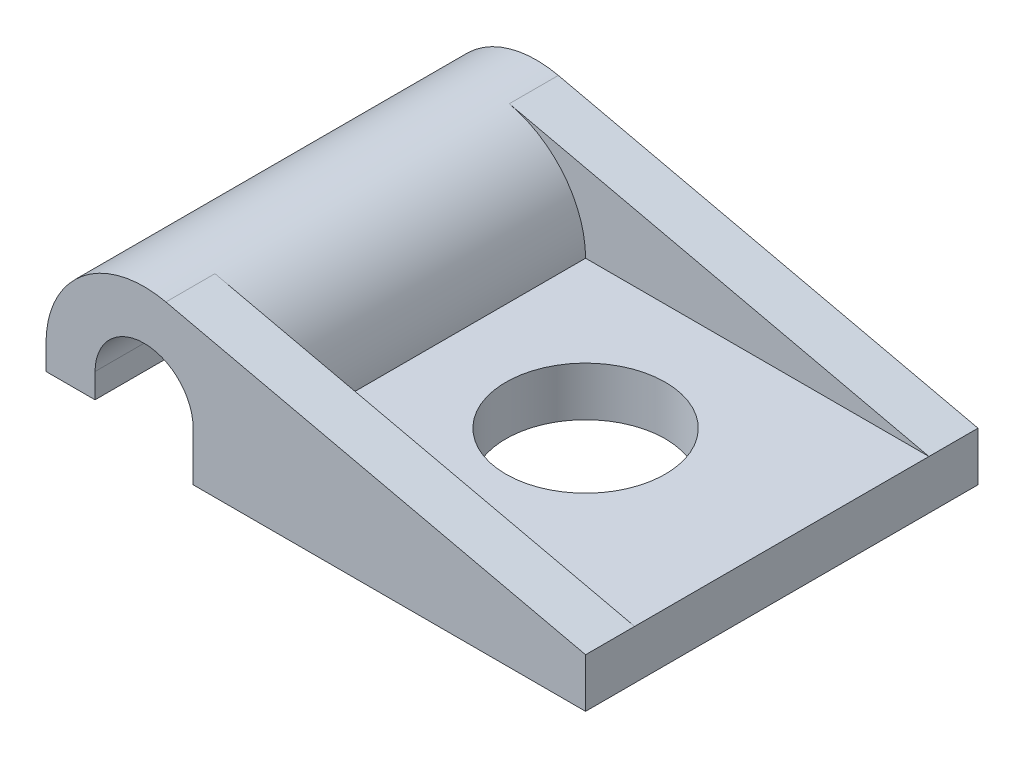
ISO-10303-21;
HEADER;
FILE_DESCRIPTION(('STEP AP214'),'2;1');
FILE_NAME('part.step','',(''),(''),'','','');
FILE_SCHEMA(('AUTOMOTIVE_DESIGN { 1 0 10303 214 1 1 1 1 }'));
ENDSEC;
DATA;
#1=APPLICATION_CONTEXT('core data for automotive mechanical design processes');
#2=APPLICATION_PROTOCOL_DEFINITION('international standard','automotive_design',2000,#1);
#3=PRODUCT_CONTEXT('',#1,'mechanical');
#4=PRODUCT('Part','Part','',(#3));
#5=PRODUCT_RELATED_PRODUCT_CATEGORY('part','',(#4));
#6=PRODUCT_DEFINITION_FORMATION('','',#4);
#7=PRODUCT_DEFINITION_CONTEXT('part definition',#1,'design');
#8=PRODUCT_DEFINITION('design','',#6,#7);
#9=PRODUCT_DEFINITION_SHAPE('','',#8);
#10=(LENGTH_UNIT() NAMED_UNIT(*) SI_UNIT(.MILLI.,.METRE.));
#11=(NAMED_UNIT(*) PLANE_ANGLE_UNIT() SI_UNIT($,.RADIAN.));
#12=(NAMED_UNIT(*) SI_UNIT($,.STERADIAN.) SOLID_ANGLE_UNIT());
#13=UNCERTAINTY_MEASURE_WITH_UNIT(LENGTH_MEASURE(1.E-05),#10,'distance_accuracy_value','');
#14=(GEOMETRIC_REPRESENTATION_CONTEXT(3) GLOBAL_UNCERTAINTY_ASSIGNED_CONTEXT((#13)) GLOBAL_UNIT_ASSIGNED_CONTEXT((#10,
#11,#12)) REPRESENTATION_CONTEXT('',''));
#15=CARTESIAN_POINT('',(0.,0.,0.));
#16=DIRECTION('',(0.,0.,1.));
#17=DIRECTION('',(1.,0.,0.));
#18=AXIS2_PLACEMENT_3D('',#15,#16,#17);
#19=CARTESIAN_POINT('',(1.5875,0.,6.35));
#20=DIRECTION('',(0.,1.,0.));
#21=DIRECTION('',(-1.,0.,0.));
#22=AXIS2_PLACEMENT_3D('',#19,#20,#21);
#23=PLANE('',#22);
#24=DIRECTION('',(1.,0.,0.));
#25=VECTOR('',#24,1.);
#26=CARTESIAN_POINT('',(1.5875,0.,-6.35));
#27=LINE('',#26,#25);
#28=CARTESIAN_POINT('',(1.5875,0.,-6.35));
#29=VERTEX_POINT('',#28);
#30=CARTESIAN_POINT('',(14.2875,0.,-6.35));
#31=VERTEX_POINT('',#30);
#32=EDGE_CURVE('E155',#29,#31,#27,.T.);
#33=ORIENTED_EDGE('',*,*,#32,.T.);
#34=DIRECTION('',(0.,0.,-1.));
#35=VECTOR('',#34,1.);
#36=CARTESIAN_POINT('',(14.2875,0.,6.35));
#37=LINE('',#36,#35);
#38=CARTESIAN_POINT('',(14.2875,0.,6.35));
#39=VERTEX_POINT('',#38);
#40=EDGE_CURVE('E181',#39,#31,#37,.T.);
#41=ORIENTED_EDGE('',*,*,#40,.F.);
#42=DIRECTION('',(1.,0.,0.));
#43=VECTOR('',#42,1.);
#44=CARTESIAN_POINT('',(1.5875,0.,6.35));
#45=LINE('',#44,#43);
#46=CARTESIAN_POINT('',(1.5875,0.,6.35));
#47=VERTEX_POINT('',#46);
#48=EDGE_CURVE('E225',#47,#39,#45,.T.);
#49=ORIENTED_EDGE('',*,*,#48,.F.);
#50=DIRECTION('',(0.,0.,-1.));
#51=VECTOR('',#50,1.);
#52=CARTESIAN_POINT('',(1.5875,0.,6.35));
#53=LINE('',#52,#51);
#54=EDGE_CURVE('E184',#47,#29,#53,.T.);
#55=ORIENTED_EDGE('',*,*,#54,.T.);
#56=EDGE_LOOP('',(#33,#41,#49,#55));
#57=FACE_BOUND('',#56,.T.);
#58=CARTESIAN_POINT('',(7.9375,0.,0.));
#59=DIRECTION('',(0.,1.,0.));
#60=DIRECTION('',(0.,0.,1.));
#61=AXIS2_PLACEMENT_3D('',#58,#59,#60);
#62=CIRCLE('',#61,2.5796875);
#63=CARTESIAN_POINT('',(7.9375,0.,2.5796875));
#64=VERTEX_POINT('',#63);
#65=EDGE_CURVE('E236',#64,#64,#62,.T.);
#66=ORIENTED_EDGE('',*,*,#65,.T.);
#67=EDGE_LOOP('',(#66));
#68=FACE_BOUND('',#67,.T.);
#69=ADVANCED_FACE('F34',(#57,#68),#23,.F.);
#70=CARTESIAN_POINT('',(3.17500000000012,1.5875,4.76249999999988));
#71=DIRECTION('',(0.,1.,0.));
#72=DIRECTION('',(0.,0.,1.));
#73=AXIS2_PLACEMENT_3D('',#70,#71,#72);
#74=PLANE('',#73);
#75=DIRECTION('',(0.,0.,1.));
#76=VECTOR('',#75,1.);
#77=CARTESIAN_POINT('',(3.17500000000012,1.5875,-4.76249999999988));
#78=LINE('',#77,#76);
#79=CARTESIAN_POINT('',(3.17500000000012,1.5875,-4.76249999999988));
#80=VERTEX_POINT('',#79);
#81=CARTESIAN_POINT('',(3.17500000000012,1.5875,4.76249999999988));
#82=VERTEX_POINT('',#81);
#83=EDGE_CURVE('E209',#80,#82,#78,.T.);
#84=ORIENTED_EDGE('',*,*,#83,.T.);
#85=DIRECTION('',(1.,0.,0.));
#86=VECTOR('',#85,1.);
#87=CARTESIAN_POINT('',(3.17500000000012,1.5875,4.76249999999988));
#88=LINE('',#87,#86);
#89=CARTESIAN_POINT('',(14.2875,1.5875,4.7625));
#90=VERTEX_POINT('',#89);
#91=EDGE_CURVE('E50',#82,#90,#88,.T.);
#92=ORIENTED_EDGE('',*,*,#91,.T.);
#93=DIRECTION('',(0.,0.,-1.));
#94=VECTOR('',#93,1.);
#95=CARTESIAN_POINT('',(14.2875,1.5875,-4.7625));
#96=LINE('',#95,#94);
#97=CARTESIAN_POINT('',(14.2875,1.5875,-4.7625));
#98=VERTEX_POINT('',#97);
#99=EDGE_CURVE('E230',#90,#98,#96,.T.);
#100=ORIENTED_EDGE('',*,*,#99,.T.);
#101=DIRECTION('',(-1.,0.,0.));
#102=VECTOR('',#101,1.);
#103=CARTESIAN_POINT('',(3.17500000000012,1.5875,-4.76249999999988));
#104=LINE('',#103,#102);
#105=EDGE_CURVE('E153',#98,#80,#104,.T.);
#106=ORIENTED_EDGE('',*,*,#105,.T.);
#107=EDGE_LOOP('',(#84,#92,#100,#106));
#108=FACE_BOUND('',#107,.T.);
#109=CARTESIAN_POINT('',(7.9375,1.5875,0.));
#110=DIRECTION('',(0.,1.,0.));
#111=DIRECTION('',(0.,0.,1.));
#112=AXIS2_PLACEMENT_3D('',#109,#110,#111);
#113=CIRCLE('',#112,2.5796875);
#114=CARTESIAN_POINT('',(7.9375,1.5875,2.5796875));
#115=VERTEX_POINT('',#114);
#116=EDGE_CURVE('E38',#115,#115,#113,.F.);
#117=ORIENTED_EDGE('',*,*,#116,.T.);
#118=EDGE_LOOP('',(#117));
#119=FACE_BOUND('',#118,.T.);
#120=ADVANCED_FACE('F243',(#108,#119),#74,.T.);
#121=CARTESIAN_POINT('',(14.2875,1.5875,6.35));
#122=DIRECTION('',(-0.222222222222222,-0.974996043043569,0.));
#123=DIRECTION('',(0.974996043043569,-0.222222222222222,0.));
#124=AXIS2_PLACEMENT_3D('',#121,#122,#123);
#125=PLANE('',#124);
#126=DIRECTION('',(0.974996043043569,-0.222222222222222,0.));
#127=VECTOR('',#126,1.);
#128=CARTESIAN_POINT('',(14.2875,1.5875,4.7625));
#129=LINE('',#128,#127);
#130=CARTESIAN_POINT('',(0.705555555555576,4.68311243666342,4.76249999999985));
#131=VERTEX_POINT('',#130);
#132=EDGE_CURVE('E11',#131,#90,#129,.T.);
#133=ORIENTED_EDGE('',*,*,#132,.F.);
#134=DIRECTION('',(0.,0.,-1.));
#135=VECTOR('',#134,1.);
#136=CARTESIAN_POINT('',(0.705555555555569,4.68311243666339,6.35));
#137=LINE('',#136,#135);
#138=CARTESIAN_POINT('',(0.705555555555569,4.68311243666339,6.35));
#139=VERTEX_POINT('',#138);
#140=EDGE_CURVE('E174',#139,#131,#137,.T.);
#141=ORIENTED_EDGE('',*,*,#140,.F.);
#142=DIRECTION('',(-0.974996043043569,0.222222222222222,0.));
#143=VECTOR('',#142,1.);
#144=CARTESIAN_POINT('',(14.2875,1.5875,6.35));
#145=LINE('',#144,#143);
#146=CARTESIAN_POINT('',(14.2875,1.5875,6.35));
#147=VERTEX_POINT('',#146);
#148=EDGE_CURVE('E220',#147,#139,#145,.T.);
#149=ORIENTED_EDGE('',*,*,#148,.F.);
#150=DIRECTION('',(0.,0.,-1.));
#151=VECTOR('',#150,1.);
#152=CARTESIAN_POINT('',(14.2875,1.5875,6.35));
#153=LINE('',#152,#151);
#154=EDGE_CURVE('E178',#147,#90,#153,.T.);
#155=ORIENTED_EDGE('',*,*,#154,.T.);
#156=EDGE_LOOP('',(#133,#141,#149,#155));
#157=FACE_BOUND('',#156,.T.);
#158=ADVANCED_FACE('F261',(#157),#125,.F.);
#159=CARTESIAN_POINT('',(0.705555555555576,4.68311243666342,-4.76249999999985));
#160=VERTEX_POINT('',#159);
#161=CARTESIAN_POINT('',(0.705555555555569,4.68311243666339,-6.35));
#162=VERTEX_POINT('',#161);
#163=EDGE_CURVE('E173',#160,#162,#137,.T.);
#164=ORIENTED_EDGE('',*,*,#163,.F.);
#165=DIRECTION('',(-0.974996043043569,0.222222222222222,0.));
#166=VECTOR('',#165,1.);
#167=CARTESIAN_POINT('',(14.2874999999999,1.58750000000003,-4.7625));
#168=LINE('',#167,#166);
#169=EDGE_CURVE('E43',#98,#160,#168,.T.);
#170=ORIENTED_EDGE('',*,*,#169,.F.);
#171=CARTESIAN_POINT('',(14.2875,1.5875,-6.35));
#172=VERTEX_POINT('',#171);
#173=EDGE_CURVE('E177',#98,#172,#153,.T.);
#174=ORIENTED_EDGE('',*,*,#173,.T.);
#175=DIRECTION('',(-0.974996043043569,0.222222222222222,0.));
#176=VECTOR('',#175,1.);
#177=CARTESIAN_POINT('',(14.2875,1.5875,-6.35));
#178=LINE('',#177,#176);
#179=EDGE_CURVE('E160',#172,#162,#178,.T.);
#180=ORIENTED_EDGE('',*,*,#179,.T.);
#181=EDGE_LOOP('',(#164,#170,#174,#180));
#182=FACE_BOUND('',#181,.T.);
#183=ADVANCED_FACE('F212',(#182),#125,.F.);
#184=CARTESIAN_POINT('',(0.,1.5875,6.35));
#185=DIRECTION('',(0.,0.,-1.));
#186=DIRECTION('',(-1.,0.,0.));
#187=AXIS2_PLACEMENT_3D('',#184,#185,#186);
#188=CYLINDRICAL_SURFACE('',#187,1.5875);
#189=CARTESIAN_POINT('',(0.,1.5875,-6.35));
#190=DIRECTION('',(0.,0.,-1.));
#191=DIRECTION('',(1.,0.,0.));
#192=AXIS2_PLACEMENT_3D('',#189,#190,#191);
#193=CIRCLE('',#192,1.5875);
#194=CARTESIAN_POINT('',(-1.5875,1.5875,-6.35));
#195=VERTEX_POINT('',#194);
#196=CARTESIAN_POINT('',(1.5875,1.5875,-6.35));
#197=VERTEX_POINT('',#196);
#198=EDGE_CURVE('E149',#195,#197,#193,.T.);
#199=ORIENTED_EDGE('',*,*,#198,.T.);
#200=DIRECTION('',(0.,0.,-1.));
#201=VECTOR('',#200,1.);
#202=CARTESIAN_POINT('',(1.5875,1.5875,6.35));
#203=LINE('',#202,#201);
#204=CARTESIAN_POINT('',(1.5875,1.5875,6.35));
#205=VERTEX_POINT('',#204);
#206=EDGE_CURVE('E187',#205,#197,#203,.T.);
#207=ORIENTED_EDGE('',*,*,#206,.F.);
#208=CARTESIAN_POINT('',(0.,1.5875,6.35));
#209=DIRECTION('',(0.,0.,-1.));
#210=DIRECTION('',(1.,0.,0.));
#211=AXIS2_PLACEMENT_3D('',#208,#209,#210);
#212=CIRCLE('',#211,1.5875);
#213=CARTESIAN_POINT('',(-1.5875,1.5875,6.35));
#214=VERTEX_POINT('',#213);
#215=EDGE_CURVE('E169',#214,#205,#212,.T.);
#216=ORIENTED_EDGE('',*,*,#215,.F.);
#217=DIRECTION('',(0.,0.,-1.));
#218=VECTOR('',#217,1.);
#219=CARTESIAN_POINT('',(-1.5875,1.5875,6.35));
#220=LINE('',#219,#218);
#221=EDGE_CURVE('E145',#214,#195,#220,.T.);
#222=ORIENTED_EDGE('',*,*,#221,.T.);
#223=EDGE_LOOP('',(#199,#207,#216,#222));
#224=FACE_BOUND('',#223,.T.);
#225=ADVANCED_FACE('F36',(#224),#188,.F.);
#226=CARTESIAN_POINT('',(1.5875,1.5875,6.35));
#227=DIRECTION('',(1.,0.,0.));
#228=DIRECTION('',(0.,0.,-1.));
#229=AXIS2_PLACEMENT_3D('',#226,#227,#228);
#230=PLANE('',#229);
#231=DIRECTION('',(0.,-1.,0.));
#232=VECTOR('',#231,1.);
#233=CARTESIAN_POINT('',(1.5875,1.5875,-6.35));
#234=LINE('',#233,#232);
#235=EDGE_CURVE('E152',#197,#29,#234,.T.);
#236=ORIENTED_EDGE('',*,*,#235,.T.);
#237=ORIENTED_EDGE('',*,*,#54,.F.);
#238=DIRECTION('',(0.,-1.,0.));
#239=VECTOR('',#238,1.);
#240=CARTESIAN_POINT('',(1.5875,1.5875,6.35));
#241=LINE('',#240,#239);
#242=EDGE_CURVE('E103',#205,#47,#241,.T.);
#243=ORIENTED_EDGE('',*,*,#242,.F.);
#244=ORIENTED_EDGE('',*,*,#206,.T.);
#245=EDGE_LOOP('',(#236,#237,#243,#244));
#246=FACE_BOUND('',#245,.T.);
#247=ADVANCED_FACE('F265',(#246),#230,.F.);
#248=CARTESIAN_POINT('',(14.2875,0.,6.35));
#249=DIRECTION('',(-1.,0.,0.));
#250=DIRECTION('',(0.,0.,1.));
#251=AXIS2_PLACEMENT_3D('',#248,#249,#250);
#252=PLANE('',#251);
#253=DIRECTION('',(0.,1.,0.));
#254=VECTOR('',#253,1.);
#255=CARTESIAN_POINT('',(14.2875,0.,-6.35));
#256=LINE('',#255,#254);
#257=EDGE_CURVE('E157',#31,#172,#256,.T.);
#258=ORIENTED_EDGE('',*,*,#257,.T.);
#259=ORIENTED_EDGE('',*,*,#173,.F.);
#260=ORIENTED_EDGE('',*,*,#99,.F.);
#261=ORIENTED_EDGE('',*,*,#154,.F.);
#262=DIRECTION('',(0.,1.,0.));
#263=VECTOR('',#262,1.);
#264=CARTESIAN_POINT('',(14.2875,0.,6.35));
#265=LINE('',#264,#263);
#266=EDGE_CURVE('E221',#39,#147,#265,.T.);
#267=ORIENTED_EDGE('',*,*,#266,.F.);
#268=ORIENTED_EDGE('',*,*,#40,.T.);
#269=EDGE_LOOP('',(#258,#259,#260,#261,#267,#268));
#270=FACE_BOUND('',#269,.T.);
#271=ADVANCED_FACE('F263',(#270),#252,.F.);
#272=CARTESIAN_POINT('',(0.,1.5875,6.35));
#273=DIRECTION('',(0.,0.,-1.));
#274=DIRECTION('',(-1.,0.,0.));
#275=AXIS2_PLACEMENT_3D('',#272,#273,#274);
#276=CYLINDRICAL_SURFACE('',#275,3.17500000000006);
#277=CARTESIAN_POINT('',(0.,1.5875,-6.35));
#278=DIRECTION('',(0.,0.,1.));
#279=DIRECTION('',(-1.,0.,0.));
#280=AXIS2_PLACEMENT_3D('',#277,#278,#279);
#281=CIRCLE('',#280,3.17500000000006);
#282=CARTESIAN_POINT('',(-3.17500000000012,1.5875,-6.35));
#283=VERTEX_POINT('',#282);
#284=EDGE_CURVE('E163',#162,#283,#281,.T.);
#285=ORIENTED_EDGE('',*,*,#284,.T.);
#286=DIRECTION('',(0.,0.,-1.));
#287=VECTOR('',#286,1.);
#288=CARTESIAN_POINT('',(-3.17500000000012,1.5875,6.35));
#289=LINE('',#288,#287);
#290=CARTESIAN_POINT('',(-3.17500000000012,1.5875,6.35));
#291=VERTEX_POINT('',#290);
#292=EDGE_CURVE('E140',#291,#283,#289,.T.);
#293=ORIENTED_EDGE('',*,*,#292,.F.);
#294=CARTESIAN_POINT('',(0.,1.5875,6.35));
#295=DIRECTION('',(0.,0.,1.));
#296=DIRECTION('',(-1.,0.,0.));
#297=AXIS2_PLACEMENT_3D('',#294,#295,#296);
#298=CIRCLE('',#297,3.17500000000006);
#299=EDGE_CURVE('E128',#139,#291,#298,.T.);
#300=ORIENTED_EDGE('',*,*,#299,.F.);
#301=ORIENTED_EDGE('',*,*,#140,.T.);
#302=CARTESIAN_POINT('',(0.,1.5875,4.76249999999984));
#303=DIRECTION('',(0.,0.,-1.));
#304=DIRECTION('',(-1.,0.,0.));
#305=AXIS2_PLACEMENT_3D('',#302,#303,#304);
#306=CIRCLE('',#305,3.17500000000009);
#307=EDGE_CURVE('E210',#82,#131,#306,.F.);
#308=ORIENTED_EDGE('',*,*,#307,.F.);
#309=ORIENTED_EDGE('',*,*,#83,.F.);
#310=CARTESIAN_POINT('',(0.,1.5875,-4.76249999999984));
#311=DIRECTION('',(0.,0.,1.));
#312=DIRECTION('',(1.,0.,0.));
#313=AXIS2_PLACEMENT_3D('',#310,#311,#312);
#314=CIRCLE('',#313,3.17500000000009);
#315=EDGE_CURVE('E198',#80,#160,#314,.T.);
#316=ORIENTED_EDGE('',*,*,#315,.T.);
#317=ORIENTED_EDGE('',*,*,#163,.T.);
#318=EDGE_LOOP('',(#285,#293,#300,#301,#308,#309,#316,#317));
#319=FACE_BOUND('',#318,.T.);
#320=ADVANCED_FACE('F207',(#319),#276,.T.);
#321=CARTESIAN_POINT('',(-3.17500000000012,0.79375,6.35));
#322=DIRECTION('',(1.,0.,0.));
#323=DIRECTION('',(0.,0.,-1.));
#324=AXIS2_PLACEMENT_3D('',#321,#322,#323);
#325=PLANE('',#324);
#326=DIRECTION('',(0.,-1.,0.));
#327=VECTOR('',#326,1.);
#328=CARTESIAN_POINT('',(-3.17500000000012,0.79375,-6.35));
#329=LINE('',#328,#327);
#330=CARTESIAN_POINT('',(-3.17500000000012,0.79375,-6.35));
#331=VERTEX_POINT('',#330);
#332=EDGE_CURVE('E137',#283,#331,#329,.T.);
#333=ORIENTED_EDGE('',*,*,#332,.T.);
#334=DIRECTION('',(0.,0.,-1.));
#335=VECTOR('',#334,1.);
#336=CARTESIAN_POINT('',(-3.17500000000012,0.79375,6.35));
#337=LINE('',#336,#335);
#338=CARTESIAN_POINT('',(-3.17500000000012,0.79375,6.35));
#339=VERTEX_POINT('',#338);
#340=EDGE_CURVE('E134',#339,#331,#337,.T.);
#341=ORIENTED_EDGE('',*,*,#340,.F.);
#342=DIRECTION('',(0.,-1.,0.));
#343=VECTOR('',#342,1.);
#344=CARTESIAN_POINT('',(-3.17500000000012,0.79375,6.35));
#345=LINE('',#344,#343);
#346=EDGE_CURVE('E121',#291,#339,#345,.T.);
#347=ORIENTED_EDGE('',*,*,#346,.F.);
#348=ORIENTED_EDGE('',*,*,#292,.T.);
#349=EDGE_LOOP('',(#333,#341,#347,#348));
#350=FACE_BOUND('',#349,.T.);
#351=ADVANCED_FACE('F135',(#350),#325,.F.);
#352=CARTESIAN_POINT('',(-1.5875,0.79375,6.35));
#353=DIRECTION('',(0.,1.,0.));
#354=DIRECTION('',(0.,0.,1.));
#355=AXIS2_PLACEMENT_3D('',#352,#353,#354);
#356=PLANE('',#355);
#357=DIRECTION('',(1.,0.,0.));
#358=VECTOR('',#357,1.);
#359=CARTESIAN_POINT('',(-1.5875,0.79375,-6.35));
#360=LINE('',#359,#358);
#361=CARTESIAN_POINT('',(-1.5875,0.79375,-6.35));
#362=VERTEX_POINT('',#361);
#363=EDGE_CURVE('E166',#331,#362,#360,.T.);
#364=ORIENTED_EDGE('',*,*,#363,.T.);
#365=DIRECTION('',(0.,0.,-1.));
#366=VECTOR('',#365,1.);
#367=CARTESIAN_POINT('',(-1.5875,0.79375,6.35));
#368=LINE('',#367,#366);
#369=CARTESIAN_POINT('',(-1.5875,0.79375,6.35));
#370=VERTEX_POINT('',#369);
#371=EDGE_CURVE('E141',#370,#362,#368,.T.);
#372=ORIENTED_EDGE('',*,*,#371,.F.);
#373=DIRECTION('',(1.,0.,0.));
#374=VECTOR('',#373,1.);
#375=CARTESIAN_POINT('',(-1.5875,0.79375,6.35));
#376=LINE('',#375,#374);
#377=EDGE_CURVE('E125',#339,#370,#376,.T.);
#378=ORIENTED_EDGE('',*,*,#377,.F.);
#379=ORIENTED_EDGE('',*,*,#340,.T.);
#380=EDGE_LOOP('',(#364,#372,#378,#379));
#381=FACE_BOUND('',#380,.T.);
#382=ADVANCED_FACE('F143',(#381),#356,.F.);
#383=CARTESIAN_POINT('',(-1.5875,1.5875,6.35));
#384=DIRECTION('',(-1.,0.,0.));
#385=DIRECTION('',(0.,0.,1.));
#386=AXIS2_PLACEMENT_3D('',#383,#384,#385);
#387=PLANE('',#386);
#388=DIRECTION('',(0.,1.,0.));
#389=VECTOR('',#388,1.);
#390=CARTESIAN_POINT('',(-1.5875,1.5875,-6.35));
#391=LINE('',#390,#389);
#392=EDGE_CURVE('E94',#362,#195,#391,.T.);
#393=ORIENTED_EDGE('',*,*,#392,.T.);
#394=ORIENTED_EDGE('',*,*,#221,.F.);
#395=DIRECTION('',(0.,1.,0.));
#396=VECTOR('',#395,1.);
#397=CARTESIAN_POINT('',(-1.5875,1.5875,6.35));
#398=LINE('',#397,#396);
#399=EDGE_CURVE('E58',#370,#214,#398,.T.);
#400=ORIENTED_EDGE('',*,*,#399,.F.);
#401=ORIENTED_EDGE('',*,*,#371,.T.);
#402=EDGE_LOOP('',(#393,#394,#400,#401));
#403=FACE_BOUND('',#402,.T.);
#404=ADVANCED_FACE('F282',(#403),#387,.F.);
#405=CARTESIAN_POINT('',(0.,1.5875,6.35));
#406=DIRECTION('',(0.,0.,1.));
#407=DIRECTION('',(1.,0.,0.));
#408=AXIS2_PLACEMENT_3D('',#405,#406,#407);
#409=PLANE('',#408);
#410=ORIENTED_EDGE('',*,*,#215,.T.);
#411=ORIENTED_EDGE('',*,*,#242,.T.);
#412=ORIENTED_EDGE('',*,*,#48,.T.);
#413=ORIENTED_EDGE('',*,*,#266,.T.);
#414=ORIENTED_EDGE('',*,*,#148,.T.);
#415=ORIENTED_EDGE('',*,*,#299,.T.);
#416=ORIENTED_EDGE('',*,*,#346,.T.);
#417=ORIENTED_EDGE('',*,*,#377,.T.);
#418=ORIENTED_EDGE('',*,*,#399,.T.);
#419=EDGE_LOOP('',(#410,#411,#412,#413,#414,#415,#416,#417,#418));
#420=FACE_BOUND('',#419,.T.);
#421=ADVANCED_FACE('F123',(#420),#409,.T.);
#422=CARTESIAN_POINT('',(0.,1.5875,-6.35));
#423=DIRECTION('',(0.,0.,1.));
#424=DIRECTION('',(1.,0.,0.));
#425=AXIS2_PLACEMENT_3D('',#422,#423,#424);
#426=PLANE('',#425);
#427=ORIENTED_EDGE('',*,*,#198,.F.);
#428=ORIENTED_EDGE('',*,*,#392,.F.);
#429=ORIENTED_EDGE('',*,*,#363,.F.);
#430=ORIENTED_EDGE('',*,*,#332,.F.);
#431=ORIENTED_EDGE('',*,*,#284,.F.);
#432=ORIENTED_EDGE('',*,*,#179,.F.);
#433=ORIENTED_EDGE('',*,*,#257,.F.);
#434=ORIENTED_EDGE('',*,*,#32,.F.);
#435=ORIENTED_EDGE('',*,*,#235,.F.);
#436=EDGE_LOOP('',(#427,#428,#429,#430,#431,#432,#433,#434,#435));
#437=FACE_BOUND('',#436,.T.);
#438=ADVANCED_FACE('F218',(#437),#426,.F.);
#439=CARTESIAN_POINT('',(3.17500000000012,4.76250000000006,4.76249999999988));
#440=DIRECTION('',(0.,0.,-1.));
#441=DIRECTION('',(-1.,0.,0.));
#442=AXIS2_PLACEMENT_3D('',#439,#440,#441);
#443=PLANE('',#442);
#444=ORIENTED_EDGE('',*,*,#132,.T.);
#445=ORIENTED_EDGE('',*,*,#91,.F.);
#446=ORIENTED_EDGE('',*,*,#307,.T.);
#447=EDGE_LOOP('',(#444,#445,#446));
#448=FACE_BOUND('',#447,.T.);
#449=ADVANCED_FACE('F252',(#448),#443,.T.);
#450=CARTESIAN_POINT('',(3.17500000000012,4.76250000000006,-4.76249999999988));
#451=DIRECTION('',(0.,0.,1.));
#452=DIRECTION('',(1.,0.,0.));
#453=AXIS2_PLACEMENT_3D('',#450,#451,#452);
#454=PLANE('',#453);
#455=ORIENTED_EDGE('',*,*,#169,.T.);
#456=ORIENTED_EDGE('',*,*,#315,.F.);
#457=ORIENTED_EDGE('',*,*,#105,.F.);
#458=EDGE_LOOP('',(#455,#456,#457));
#459=FACE_BOUND('',#458,.T.);
#460=ADVANCED_FACE('F196',(#459),#454,.T.);
#461=CARTESIAN_POINT('',(7.9375,2.54,0.));
#462=DIRECTION('',(0.,-1.,0.));
#463=DIRECTION('',(0.,0.,-1.));
#464=AXIS2_PLACEMENT_3D('',#461,#462,#463);
#465=CYLINDRICAL_SURFACE('',#464,2.5796875);
#466=ORIENTED_EDGE('',*,*,#116,.F.);
#467=EDGE_LOOP('',(#466));
#468=FACE_BOUND('',#467,.T.);
#469=ORIENTED_EDGE('',*,*,#65,.F.);
#470=EDGE_LOOP('',(#469));
#471=FACE_BOUND('',#470,.T.);
#472=ADVANCED_FACE('F245',(#468,#471),#465,.F.);
#473=CLOSED_SHELL('',(#69,#120,#158,#183,#225,#247,#271,#320,#351,#382,#404,#421,#438,#449,#460,#472));
#474=MANIFOLD_SOLID_BREP('B2',#473);
#475=ADVANCED_BREP_SHAPE_REPRESENTATION('',(#18,#474),#14);
#476=SHAPE_DEFINITION_REPRESENTATION(#9,#475);
ENDSEC;
END-ISO-10303-21;
